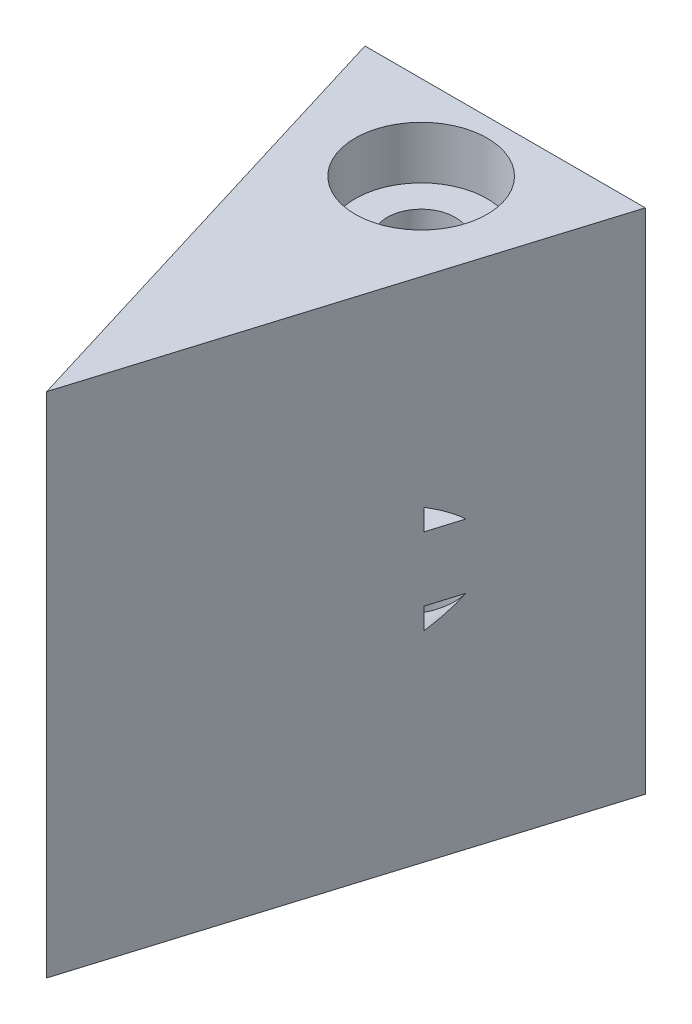
ISO-10303-21;
HEADER;
FILE_DESCRIPTION(('STEP AP214'),'2;1');
FILE_NAME('part.step','',(''),(''),'','','');
FILE_SCHEMA(('AUTOMOTIVE_DESIGN { 1 0 10303 214 1 1 1 1 }'));
ENDSEC;
DATA;
#1=APPLICATION_CONTEXT('core data for automotive mechanical design processes');
#2=APPLICATION_PROTOCOL_DEFINITION('international standard','automotive_design',2000,#1);
#3=PRODUCT_CONTEXT('',#1,'mechanical');
#4=PRODUCT('Part','Part','',(#3));
#5=PRODUCT_RELATED_PRODUCT_CATEGORY('part','',(#4));
#6=PRODUCT_DEFINITION_FORMATION('','',#4);
#7=PRODUCT_DEFINITION_CONTEXT('part definition',#1,'design');
#8=PRODUCT_DEFINITION('design','',#6,#7);
#9=PRODUCT_DEFINITION_SHAPE('','',#8);
#10=(LENGTH_UNIT() NAMED_UNIT(*) SI_UNIT(.MILLI.,.METRE.));
#11=(NAMED_UNIT(*) PLANE_ANGLE_UNIT() SI_UNIT($,.RADIAN.));
#12=(NAMED_UNIT(*) SI_UNIT($,.STERADIAN.) SOLID_ANGLE_UNIT());
#13=UNCERTAINTY_MEASURE_WITH_UNIT(LENGTH_MEASURE(1.E-05),#10,'distance_accuracy_value','');
#14=(GEOMETRIC_REPRESENTATION_CONTEXT(3) GLOBAL_UNCERTAINTY_ASSIGNED_CONTEXT((#13)) GLOBAL_UNIT_ASSIGNED_CONTEXT((#10,
#11,#12)) REPRESENTATION_CONTEXT('',''));
#15=CARTESIAN_POINT('',(0.,0.,0.));
#16=DIRECTION('',(0.,0.,1.));
#17=DIRECTION('',(1.,0.,0.));
#18=AXIS2_PLACEMENT_3D('',#15,#16,#17);
#19=CARTESIAN_POINT('',(-4.15957630186494,-2.51,4.56537000902889));
#20=DIRECTION('',(0.956304755963033,0.,-0.292371704722745));
#21=DIRECTION('',(-0.292371704722745,0.,-0.956304755963033));
#22=AXIS2_PLACEMENT_3D('',#19,#20,#21);
#23=PLANE('',#22);
#24=DIRECTION('',(0.,-1.,0.));
#25=VECTOR('',#24,1.);
#26=CARTESIAN_POINT('',(-2.63092289457158,5.,9.56537000902889));
#27=LINE('',#26,#25);
#28=CARTESIAN_POINT('',(-2.63092289457158,6.57662125269602,9.56537000902889));
#29=VERTEX_POINT('',#28);
#30=CARTESIAN_POINT('',(-2.63092289457158,5.95,9.56537000902889));
#31=VERTEX_POINT('',#30);
#32=EDGE_CURVE('E41',#29,#31,#27,.T.);
#33=ORIENTED_EDGE('',*,*,#32,.T.);
#34=DIRECTION('',(0.292371704722745,0.,0.956304755963033));
#35=VECTOR('',#34,1.);
#36=CARTESIAN_POINT('',(-2.15999244561512,5.95,11.105714101122));
#37=LINE('',#36,#35);
#38=CARTESIAN_POINT('',(-2.91830463710175,5.95,8.62538668396958));
#39=VERTEX_POINT('',#38);
#40=EDGE_CURVE('E168',#39,#31,#37,.T.);
#41=ORIENTED_EDGE('',*,*,#40,.F.);
#42=CARTESIAN_POINT('',(-0.0200292878638651,5.,18.1052181991121));
#43=DIRECTION('',(0.956304755963033,0.,-0.292371704722745));
#44=DIRECTION('',(-0.292371704722745,0.,-0.956304755963033));
#45=AXIS2_PLACEMENT_3D('',#42,#43,#44);
#46=ELLIPSE('',#45,10.4319260404912,3.05);
#47=EDGE_CURVE('E49',#29,#39,#46,.F.);
#48=ORIENTED_EDGE('',*,*,#47,.F.);
#49=EDGE_LOOP('',(#33,#41,#48));
#50=FACE_BOUND('',#49,.T.);
#51=DIRECTION('',(-0.292371704722745,0.,-0.956304755963033));
#52=VECTOR('',#51,1.);
#53=CARTESIAN_POINT('',(-2.15999244561512,4.05,11.105714101122));
#54=LINE('',#53,#52);
#55=CARTESIAN_POINT('',(-2.63092289457158,4.05,9.56537000902889));
#56=VERTEX_POINT('',#55);
#57=CARTESIAN_POINT('',(-2.91830463710175,4.05,8.62538668396958));
#58=VERTEX_POINT('',#57);
#59=EDGE_CURVE('E200',#56,#58,#54,.T.);
#60=ORIENTED_EDGE('',*,*,#59,.F.);
#61=DIRECTION('',(0.,-1.,0.));
#62=VECTOR('',#61,1.);
#63=CARTESIAN_POINT('',(-2.63092289457158,5.,9.56537000902889));
#64=LINE('',#63,#62);
#65=CARTESIAN_POINT('',(-2.63092289457158,3.42337874730398,9.56537000902889));
#66=VERTEX_POINT('',#65);
#67=EDGE_CURVE('E181',#56,#66,#64,.T.);
#68=ORIENTED_EDGE('',*,*,#67,.T.);
#69=CARTESIAN_POINT('',(-0.0200292878638651,5.,18.1052181991121));
#70=DIRECTION('',(0.956304755963033,0.,-0.292371704722745));
#71=DIRECTION('',(-0.292371704722745,0.,-0.956304755963033));
#72=AXIS2_PLACEMENT_3D('',#69,#70,#71);
#73=ELLIPSE('',#72,10.4319260404912,3.05);
#74=EDGE_CURVE('E204',#58,#66,#73,.F.);
#75=ORIENTED_EDGE('',*,*,#74,.F.);
#76=EDGE_LOOP('',(#60,#68,#75));
#77=FACE_BOUND('',#76,.T.);
#78=DIRECTION('',(0.,1.,0.));
#79=VECTOR('',#78,1.);
#80=CARTESIAN_POINT('',(-0.0200292878637983,-2.51,18.1052181991123));
#81=LINE('',#80,#79);
#82=CARTESIAN_POINT('',(-0.0200292878638,-2.5,18.1052181991123));
#83=VERTEX_POINT('',#82);
#84=CARTESIAN_POINT('',(-0.0200292878638,12.5,18.1052181991123));
#85=VERTEX_POINT('',#84);
#86=EDGE_CURVE('E11',#83,#85,#81,.T.);
#87=ORIENTED_EDGE('',*,*,#86,.T.);
#88=DIRECTION('',(-0.292371704722745,0.,-0.956304755963033));
#89=VECTOR('',#88,1.);
#90=CARTESIAN_POINT('',(-5.08047192639384,12.5,1.55325614418803));
#91=LINE('',#90,#89);
#92=CARTESIAN_POINT('',(-4.15957630186493,12.5,4.56537000902889));
#93=VERTEX_POINT('',#92);
#94=EDGE_CURVE('E182',#85,#93,#91,.T.);
#95=ORIENTED_EDGE('',*,*,#94,.T.);
#96=DIRECTION('',(0.,-1.,0.));
#97=VECTOR('',#96,1.);
#98=CARTESIAN_POINT('',(-4.15957630186494,-2.5,4.56537000902889));
#99=LINE('',#98,#97);
#100=CARTESIAN_POINT('',(-4.15957630186493,-2.5,4.56537000902889));
#101=VERTEX_POINT('',#100);
#102=EDGE_CURVE('E189',#93,#101,#99,.T.);
#103=ORIENTED_EDGE('',*,*,#102,.T.);
#104=DIRECTION('',(-0.292371704722745,0.,-0.956304755963033));
#105=VECTOR('',#104,1.);
#106=CARTESIAN_POINT('',(-5.08047192639384,-2.5,1.55325614418803));
#107=LINE('',#106,#105);
#108=EDGE_CURVE('E207',#83,#101,#107,.T.);
#109=ORIENTED_EDGE('',*,*,#108,.F.);
#110=EDGE_LOOP('',(#87,#95,#103,#109));
#111=FACE_BOUND('',#110,.T.);
#112=ADVANCED_FACE('F32',(#50,#77,#111),#23,.F.);
#113=CARTESIAN_POINT('',(-0.0200292878637983,-2.51,18.1052181991123));
#114=DIRECTION('',(-0.956304755963035,0.,-0.292371704722737));
#115=DIRECTION('',(-0.292371704722737,0.,0.956304755963036));
#116=AXIS2_PLACEMENT_3D('',#113,#114,#115);
#117=PLANE('',#116);
#118=DIRECTION('',(0.292371704722737,0.,-0.956304755963036));
#119=VECTOR('',#118,1.);
#120=CARTESIAN_POINT('',(2.61543005899706,5.95,9.48501909352394));
#121=LINE('',#120,#119);
#122=CARTESIAN_POINT('',(2.5908643188439,5.95,9.56537000902889));
#123=VERTEX_POINT('',#122);
#124=CARTESIAN_POINT('',(2.87824606137402,5.95,8.62538668396971));
#125=VERTEX_POINT('',#124);
#126=EDGE_CURVE('E196',#123,#125,#121,.T.);
#127=ORIENTED_EDGE('',*,*,#126,.F.);
#128=DIRECTION('',(0.,1.,0.));
#129=VECTOR('',#128,1.);
#130=CARTESIAN_POINT('',(2.5908643188439,5.,9.56537000902889));
#131=LINE('',#130,#129);
#132=CARTESIAN_POINT('',(2.5908643188439,6.57662125269594,9.56537000902889));
#133=VERTEX_POINT('',#132);
#134=EDGE_CURVE('E179',#123,#133,#131,.T.);
#135=ORIENTED_EDGE('',*,*,#134,.T.);
#136=CARTESIAN_POINT('',(-0.0200292878638651,5.,18.1052181991125));
#137=DIRECTION('',(-0.956304755963035,0.,-0.292371704722737));
#138=DIRECTION('',(0.292371704722737,0.,-0.956304755963036));
#139=AXIS2_PLACEMENT_3D('',#136,#137,#138);
#140=ELLIPSE('',#139,10.4319260404915,3.05);
#141=EDGE_CURVE('E57',#125,#133,#140,.F.);
#142=ORIENTED_EDGE('',*,*,#141,.F.);
#143=EDGE_LOOP('',(#127,#135,#142));
#144=FACE_BOUND('',#143,.T.);
#145=DIRECTION('',(0.,1.,0.));
#146=VECTOR('',#145,1.);
#147=CARTESIAN_POINT('',(2.5908643188439,5.,9.56537000902889));
#148=LINE('',#147,#146);
#149=CARTESIAN_POINT('',(2.5908643188439,3.42337874730406,9.56537000902889));
#150=VERTEX_POINT('',#149);
#151=CARTESIAN_POINT('',(2.5908643188439,4.05,9.56537000902889));
#152=VERTEX_POINT('',#151);
#153=EDGE_CURVE('E185',#150,#152,#148,.T.);
#154=ORIENTED_EDGE('',*,*,#153,.T.);
#155=DIRECTION('',(-0.292371704722737,0.,0.956304755963036));
#156=VECTOR('',#155,1.);
#157=CARTESIAN_POINT('',(2.61543005899706,4.05,9.48501909352394));
#158=LINE('',#157,#156);
#159=CARTESIAN_POINT('',(2.87824606137402,4.05,8.62538668396971));
#160=VERTEX_POINT('',#159);
#161=EDGE_CURVE('E203',#160,#152,#158,.T.);
#162=ORIENTED_EDGE('',*,*,#161,.F.);
#163=CARTESIAN_POINT('',(-0.0200292878638651,5.,18.1052181991125));
#164=DIRECTION('',(-0.956304755963035,0.,-0.292371704722737));
#165=DIRECTION('',(0.292371704722737,0.,-0.956304755963036));
#166=AXIS2_PLACEMENT_3D('',#163,#164,#165);
#167=ELLIPSE('',#166,10.4319260404915,3.05);
#168=EDGE_CURVE('E206',#150,#160,#167,.F.);
#169=ORIENTED_EDGE('',*,*,#168,.F.);
#170=EDGE_LOOP('',(#154,#162,#169));
#171=FACE_BOUND('',#170,.T.);
#172=DIRECTION('',(0.,1.,0.));
#173=VECTOR('',#172,1.);
#174=CARTESIAN_POINT('',(4.1195177261372,-2.5,4.56537000902889));
#175=LINE('',#174,#173);
#176=CARTESIAN_POINT('',(4.1195177261372,-2.5,4.56537000902889));
#177=VERTEX_POINT('',#176);
#178=CARTESIAN_POINT('',(4.1195177261372,12.5,4.56537000902889));
#179=VERTEX_POINT('',#178);
#180=EDGE_CURVE('E192',#177,#179,#175,.T.);
#181=ORIENTED_EDGE('',*,*,#180,.T.);
#182=DIRECTION('',(-0.292371704722737,0.,0.956304755963036));
#183=VECTOR('',#182,1.);
#184=CARTESIAN_POINT('',(5.04383760633929,12.5,1.54205590855293));
#185=LINE('',#184,#183);
#186=EDGE_CURVE('E186',#179,#85,#185,.T.);
#187=ORIENTED_EDGE('',*,*,#186,.T.);
#188=ORIENTED_EDGE('',*,*,#86,.F.);
#189=DIRECTION('',(-0.292371704722737,0.,0.956304755963036));
#190=VECTOR('',#189,1.);
#191=CARTESIAN_POINT('',(5.04383760633929,-2.5,1.54205590855293));
#192=LINE('',#191,#190);
#193=EDGE_CURVE('E36',#177,#83,#192,.T.);
#194=ORIENTED_EDGE('',*,*,#193,.F.);
#195=EDGE_LOOP('',(#181,#187,#188,#194));
#196=FACE_BOUND('',#195,.T.);
#197=ADVANCED_FACE('F34',(#144,#171,#196),#117,.F.);
#198=CARTESIAN_POINT('',(0.,10.95,7.06537000902889));
#199=DIRECTION('',(0.,1.,0.));
#200=DIRECTION('',(0.,0.,1.));
#201=AXIS2_PLACEMENT_3D('',#198,#199,#200);
#202=PLANE('',#201);
#203=CARTESIAN_POINT('',(0.,10.95,7.06537000902889));
#204=DIRECTION('',(0.,1.,0.));
#205=DIRECTION('',(0.,0.,1.));
#206=AXIS2_PLACEMENT_3D('',#203,#204,#205);
#207=CIRCLE('',#206,1.95);
#208=CARTESIAN_POINT('',(0.,10.95,9.01537000902889));
#209=VERTEX_POINT('',#208);
#210=EDGE_CURVE('E177',#209,#209,#207,.T.);
#211=ORIENTED_EDGE('',*,*,#210,.T.);
#212=EDGE_LOOP('',(#211));
#213=FACE_BOUND('',#212,.T.);
#214=CARTESIAN_POINT('',(0.,10.95,7.06537000902889));
#215=DIRECTION('',(0.,1.,0.));
#216=DIRECTION('',(0.,0.,1.));
#217=AXIS2_PLACEMENT_3D('',#214,#215,#216);
#218=CIRCLE('',#217,0.999999999999795);
#219=CARTESIAN_POINT('',(0.,10.95,8.06537000902868));
#220=VERTEX_POINT('',#219);
#221=EDGE_CURVE('E174',#220,#220,#218,.F.);
#222=ORIENTED_EDGE('',*,*,#221,.T.);
#223=EDGE_LOOP('',(#222));
#224=FACE_BOUND('',#223,.T.);
#225=ADVANCED_FACE('F250',(#213,#224),#202,.T.);
#226=CARTESIAN_POINT('',(0.,10.95,7.06537000902889));
#227=DIRECTION('',(0.,1.,0.));
#228=DIRECTION('',(0.,0.,1.));
#229=AXIS2_PLACEMENT_3D('',#226,#227,#228);
#230=CYLINDRICAL_SURFACE('',#229,1.95);
#231=CARTESIAN_POINT('',(0.,12.5,7.06537000902889));
#232=DIRECTION('',(0.,1.,0.));
#233=DIRECTION('',(0.,0.,1.));
#234=AXIS2_PLACEMENT_3D('',#231,#232,#233);
#235=CIRCLE('',#234,1.95);
#236=CARTESIAN_POINT('',(0.,12.5,9.01537000902889));
#237=VERTEX_POINT('',#236);
#238=EDGE_CURVE('E398',#237,#237,#235,.T.);
#239=CARTESIAN_POINT('',(0.,10.95,9.01537000902889));
#240=CARTESIAN_POINT('',(0.,10.9661458333333,9.01537000902889));
#241=CARTESIAN_POINT('',(0.,10.9822916666667,9.01537000902889));
#242=CARTESIAN_POINT('',(0.,11.0145833333333,9.01537000902889));
#243=CARTESIAN_POINT('',(0.,11.0307291666667,9.01537000902889));
#244=CARTESIAN_POINT('',(0.,11.0630208333333,9.01537000902889));
#245=CARTESIAN_POINT('',(0.,11.0791666666667,9.01537000902889));
#246=CARTESIAN_POINT('',(0.,11.1114583333333,9.01537000902889));
#247=CARTESIAN_POINT('',(0.,11.1276041666667,9.01537000902889));
#248=CARTESIAN_POINT('',(0.,11.1598958333333,9.01537000902889));
#249=CARTESIAN_POINT('',(0.,11.1760416666667,9.01537000902889));
#250=CARTESIAN_POINT('',(0.,11.2083333333333,9.01537000902889));
#251=CARTESIAN_POINT('',(0.,11.2244791666667,9.01537000902889));
#252=CARTESIAN_POINT('',(0.,11.2567708333333,9.01537000902889));
#253=CARTESIAN_POINT('',(0.,11.2729166666667,9.01537000902889));
#254=CARTESIAN_POINT('',(0.,11.3052083333333,9.01537000902889));
#255=CARTESIAN_POINT('',(0.,11.3213541666667,9.01537000902889));
#256=CARTESIAN_POINT('',(0.,11.3536458333333,9.01537000902889));
#257=CARTESIAN_POINT('',(0.,11.3697916666667,9.01537000902889));
#258=CARTESIAN_POINT('',(0.,11.4020833333333,9.01537000902889));
#259=CARTESIAN_POINT('',(0.,11.4182291666667,9.01537000902889));
#260=CARTESIAN_POINT('',(0.,11.4505208333333,9.01537000902889));
#261=CARTESIAN_POINT('',(0.,11.4666666666667,9.01537000902889));
#262=CARTESIAN_POINT('',(0.,11.4989583333333,9.01537000902889));
#263=CARTESIAN_POINT('',(0.,11.5151041666667,9.01537000902889));
#264=CARTESIAN_POINT('',(0.,11.5473958333333,9.01537000902889));
#265=CARTESIAN_POINT('',(0.,11.5635416666667,9.01537000902889));
#266=CARTESIAN_POINT('',(0.,11.5958333333333,9.01537000902889));
#267=CARTESIAN_POINT('',(0.,11.6119791666667,9.01537000902889));
#268=CARTESIAN_POINT('',(0.,11.6442708333333,9.01537000902889));
#269=CARTESIAN_POINT('',(0.,11.6604166666667,9.01537000902889));
#270=CARTESIAN_POINT('',(0.,11.6927083333333,9.01537000902889));
#271=CARTESIAN_POINT('',(0.,11.7088541666667,9.01537000902889));
#272=CARTESIAN_POINT('',(0.,11.7411458333333,9.01537000902889));
#273=CARTESIAN_POINT('',(0.,11.7572916666667,9.01537000902889));
#274=CARTESIAN_POINT('',(0.,11.7895833333333,9.01537000902889));
#275=CARTESIAN_POINT('',(0.,11.8057291666667,9.01537000902889));
#276=CARTESIAN_POINT('',(0.,11.8380208333333,9.01537000902889));
#277=CARTESIAN_POINT('',(0.,11.8541666666667,9.01537000902889));
#278=CARTESIAN_POINT('',(0.,11.8864583333333,9.01537000902889));
#279=CARTESIAN_POINT('',(0.,11.9026041666667,9.01537000902889));
#280=CARTESIAN_POINT('',(0.,11.9348958333333,9.01537000902889));
#281=CARTESIAN_POINT('',(0.,11.9510416666667,9.01537000902889));
#282=CARTESIAN_POINT('',(0.,11.9833333333333,9.01537000902889));
#283=CARTESIAN_POINT('',(0.,11.9994791666667,9.01537000902889));
#284=CARTESIAN_POINT('',(0.,12.0317708333333,9.01537000902889));
#285=CARTESIAN_POINT('',(0.,12.0479166666667,9.01537000902889));
#286=CARTESIAN_POINT('',(0.,12.0802083333333,9.01537000902889));
#287=CARTESIAN_POINT('',(0.,12.0963541666667,9.01537000902889));
#288=CARTESIAN_POINT('',(0.,12.1286458333333,9.01537000902889));
#289=CARTESIAN_POINT('',(0.,12.1447916666667,9.01537000902889));
#290=CARTESIAN_POINT('',(0.,12.1770833333333,9.01537000902889));
#291=CARTESIAN_POINT('',(0.,12.1932291666667,9.01537000902889));
#292=CARTESIAN_POINT('',(0.,12.2255208333333,9.01537000902889));
#293=CARTESIAN_POINT('',(0.,12.2416666666667,9.01537000902889));
#294=CARTESIAN_POINT('',(0.,12.2739583333333,9.01537000902889));
#295=CARTESIAN_POINT('',(0.,12.2901041666667,9.01537000902889));
#296=CARTESIAN_POINT('',(0.,12.3223958333333,9.01537000902889));
#297=CARTESIAN_POINT('',(0.,12.3385416666667,9.01537000902889));
#298=CARTESIAN_POINT('',(0.,12.3708333333333,9.01537000902889));
#299=CARTESIAN_POINT('',(0.,12.3869791666667,9.01537000902889));
#300=CARTESIAN_POINT('',(0.,12.4192708333333,9.01537000902889));
#301=CARTESIAN_POINT('',(0.,12.4354166666667,9.01537000902889));
#302=CARTESIAN_POINT('',(0.,12.4677083333333,9.01537000902889));
#303=CARTESIAN_POINT('',(0.,12.4838541666667,9.01537000902889));
#304=CARTESIAN_POINT('',(0.,12.5,9.01537000902889));
#305=B_SPLINE_CURVE_WITH_KNOTS('',3,(#239,#240,#241,#242,#243,#244,#245,#246,#247,#248,#249,
#250,#251,#252,#253,#254,#255,#256,#257,#258,#259,#260,#261,#262,#263,#264,#265,#266,#267,#268,
#269,#270,#271,#272,#273,#274,#275,#276,#277,#278,#279,#280,#281,#282,#283,#284,#285,#286,#287,
#288,#289,#290,#291,#292,#293,#294,#295,#296,#297,#298,#299,#300,#301,#302,#303,#304),
.UNSPECIFIED.,.F.,.F.,(4,2,2,2,2,2,2,2,2,2,2,2,2,2,2,2,2,2,2,2,2,2,2,2,2,2,2,2,2,2,2,2,4),(0.,
0.0484375000000016,0.0968750000000015,0.145312500000001,0.193750000000001,0.242187500000001,
0.290625000000001,0.339062500000001,0.387500000000001,0.435937500000001,0.484375,0.5328125,
0.58125,0.6296875,0.678125,0.7265625,0.775,0.823437500000001,0.871875000000001,
0.920312500000001,0.968750000000001,1.0171875,1.065625,1.1140625,1.1625,1.2109375,1.259375,
1.3078125,1.35625,1.4046875,1.453125,1.5015625,1.55),.UNSPECIFIED.);
#306=EDGE_CURVE('BSEAM271',#209,#237,#305,.T.);
#307=ORIENTED_EDGE('',*,*,#210,.F.);
#308=ORIENTED_EDGE('',*,*,#238,.T.);
#309=ORIENTED_EDGE('',*,*,#306,.T.);
#310=ORIENTED_EDGE('',*,*,#306,.F.);
#311=EDGE_LOOP('',(#307,#309,#308,#310));
#312=FACE_BOUND('',#311,.T.);
#313=ADVANCED_FACE('F271',(#312),#230,.F.);
#314=CARTESIAN_POINT('',(0.,-2.5,7.06537000902889));
#315=DIRECTION('',(0.,1.,0.));
#316=DIRECTION('',(0.,0.,1.));
#317=AXIS2_PLACEMENT_3D('',#314,#315,#316);
#318=CYLINDRICAL_SURFACE('',#317,0.999999999999795);
#319=CARTESIAN_POINT('',(0.,-2.5,7.06537000902889));
#320=DIRECTION('',(0.,1.,0.));
#321=DIRECTION('',(0.,0.,1.));
#322=AXIS2_PLACEMENT_3D('',#319,#320,#321);
#323=CIRCLE('',#322,0.999999999999795);
#324=CARTESIAN_POINT('',(0.,-2.5,8.06537000902868));
#325=VERTEX_POINT('',#324);
#326=EDGE_CURVE('E173',#325,#325,#323,.T.);
#327=ORIENTED_EDGE('',*,*,#326,.F.);
#328=EDGE_LOOP('',(#327));
#329=FACE_BOUND('',#328,.T.);
#330=CARTESIAN_POINT('',(0.,1.95006576667174,8.06537000902868));
#331=CARTESIAN_POINT('',(-0.0545467083170213,1.94970747285087,8.06537014842768));
#332=CARTESIAN_POINT('',(-0.109102594425875,1.95082617973328,8.0608924995377));
#333=CARTESIAN_POINT('',(-0.216630559947825,1.95586683343102,8.04314372343465));
#334=CARTESIAN_POINT('',(-0.269602455019722,1.95978910520613,8.02987157686885));
#335=CARTESIAN_POINT('',(-0.372395540865111,1.96998281568037,7.9950275098491));
#336=CARTESIAN_POINT('',(-0.422221565195225,1.97625054265354,7.973468701733));
#337=CARTESIAN_POINT('',(-0.517558158763021,1.99046661490332,7.92272142069787));
#338=CARTESIAN_POINT('',(-0.563067913976883,1.9984152762853,7.89353151248061));
#339=CARTESIAN_POINT('',(-0.649966255197754,2.0154231807719,7.82735020137387));
#340=CARTESIAN_POINT('',(-0.691194169171496,2.02450822082243,7.79015451043477));
#341=CARTESIAN_POINT('',(-0.766956256715783,2.04261595831002,7.7094526800914));
#342=CARTESIAN_POINT('',(-0.801489039696813,2.05163864242117,7.66594523299885));
#343=CARTESIAN_POINT('',(-0.863833114798163,2.06886144062743,7.57236170710818));
#344=CARTESIAN_POINT('',(-0.891427757355958,2.07703123807653,7.5221351619421));
#345=CARTESIAN_POINT('',(-0.937715224095409,2.09122999962885,7.41745339240553));
#346=CARTESIAN_POINT('',(-0.956410489644233,2.09725955075052,7.36299933254285));
#347=CARTESIAN_POINT('',(-0.98378774157987,2.10623552314352,7.25316209699885));
#348=CARTESIAN_POINT('',(-0.992758921547917,2.10927073194073,7.19785848159756));
#349=CARTESIAN_POINT('',(-1.00133622536939,2.1121705310223,7.08645414512163));
#350=CARTESIAN_POINT('',(-1.00094504098822,2.11203603262665,7.03035365779079));
#351=CARTESIAN_POINT('',(-0.991038308718468,2.10869152283109,6.92147912268892));
#352=CARTESIAN_POINT('',(-0.981911130689609,2.10561242249054,6.86866501351363));
#353=CARTESIAN_POINT('',(-0.955426185023448,2.09694560803578,6.76536168143749));
#354=CARTESIAN_POINT('',(-0.938067486579282,2.09135761022334,6.71487272216934));
#355=CARTESIAN_POINT('',(-0.895355477528405,2.07821837470153,6.6167672431692));
#356=CARTESIAN_POINT('',(-0.869886126954097,2.07063893932841,6.5692051855977));
#357=CARTESIAN_POINT('',(-0.811753224255465,2.05439616233121,6.47890419675966));
#358=CARTESIAN_POINT('',(-0.779087700884409,2.04573252399295,6.43616659191586));
#359=CARTESIAN_POINT('',(-0.705621370189618,2.02780243830253,6.35455640683283));
#360=CARTESIAN_POINT('',(-0.664503649472307,2.01852709526581,6.31597050530051));
#361=CARTESIAN_POINT('',(-0.57625917050636,2.00081162712214,6.24616898216816));
#362=CARTESIAN_POINT('',(-0.529131951252226,1.99237156618035,6.21495392653086));
#363=CARTESIAN_POINT('',(-0.42967631027486,1.97721392807559,6.16059752963539));
#364=CARTESIAN_POINT('',(-0.377310405391615,1.97051020892516,6.13752064297751));
#365=CARTESIAN_POINT('',(-0.269171299120882,1.9597079998363,6.10058591678685));
#366=CARTESIAN_POINT('',(-0.213399241292621,1.95560864074058,6.08672500152104));
#367=CARTESIAN_POINT('',(-0.10253908456766,1.95063259271298,6.06912548318687));
#368=CARTESIAN_POINT('',(-0.0475199824239522,1.94962825812152,6.06498767267624));
#369=CARTESIAN_POINT('',(0.0624178408306011,1.95061930503421,6.06580783262257));
#370=CARTESIAN_POINT('',(0.117336575934049,1.95261423039507,6.07076441998072));
#371=CARTESIAN_POINT('',(0.224019697915292,1.95932166494474,6.08932142334608));
#372=CARTESIAN_POINT('',(0.275829029613629,1.96396161104079,6.10269199072763));
#373=CARTESIAN_POINT('',(0.376441018754687,1.97545416982598,6.1374016340776));
#374=CARTESIAN_POINT('',(0.425243272951458,1.98230707850544,6.15874177606015));
#375=CARTESIAN_POINT('',(0.519942958677845,1.99778474493448,6.20943615236094));
#376=CARTESIAN_POINT('',(0.565724086676077,2.00645292462781,6.23899404054972));
#377=CARTESIAN_POINT('',(0.65180500165392,2.02458793082162,6.30504407730197));
#378=CARTESIAN_POINT('',(0.692103118494657,2.03405499924922,6.34153833062207));
#379=CARTESIAN_POINT('',(0.767932225486806,2.05327037108428,6.42234306540777));
#380=CARTESIAN_POINT('',(0.803172677487142,2.06301253612594,6.46692833440378));
#381=CARTESIAN_POINT('',(0.865699423276716,2.08125899142385,6.5616021249502));
#382=CARTESIAN_POINT('',(0.892985766856479,2.08976328942864,6.61169061204926));
#383=CARTESIAN_POINT('',(0.938651779165637,2.10448494111707,6.71586576519746));
#384=CARTESIAN_POINT('',(0.957065998669795,2.11071114322027,6.76993596046547));
#385=CARTESIAN_POINT('',(0.984445615434366,2.12011390689645,6.88066589489971));
#386=CARTESIAN_POINT('',(0.993415282022461,2.12329184635206,6.93732445192374));
#387=CARTESIAN_POINT('',(1.00132679388868,2.12609197133263,7.04845788777591));
#388=CARTESIAN_POINT('',(1.00076507768828,2.12589019545742,7.10289342027352));
#389=CARTESIAN_POINT('',(0.990844746741187,2.12238627741313,7.21085016959212));
#390=CARTESIAN_POINT('',(0.981486635847406,2.11908431282127,7.26437143860285));
#391=CARTESIAN_POINT('',(0.954582416471499,2.1098742046831,7.36800345557402));
#392=CARTESIAN_POINT('',(0.937190144831295,2.10401513574912,7.41815883854906));
#393=CARTESIAN_POINT('',(0.894835988822796,2.090358382842,7.51487803621554));
#394=CARTESIAN_POINT('',(0.869872431323104,2.08256027044038,7.56144105419678));
#395=CARTESIAN_POINT('',(0.811804845722808,2.06546338643234,7.65187315687851));
#396=CARTESIAN_POINT('',(0.778391036585527,2.05611369258926,7.69553364274029));
#397=CARTESIAN_POINT('',(0.704904242322278,2.03716191630836,7.77678571189248));
#398=CARTESIAN_POINT('',(0.664829330890099,2.02755976154021,7.81437553340602));
#399=CARTESIAN_POINT('',(0.577262492650444,2.0087087644859,7.88391432033876));
#400=CARTESIAN_POINT('',(0.529540250451134,1.99948882586492,7.91558208528871));
#401=CARTESIAN_POINT('',(0.42915302715261,1.98282933317401,7.97040925400301));
#402=CARTESIAN_POINT('',(0.376489408870778,1.97538929021161,7.99357099509525));
#403=CARTESIAN_POINT('',(0.270526055479718,1.96342787080536,8.02962243255354));
#404=CARTESIAN_POINT('',(0.21740168051063,1.95877488381879,8.04298349104672));
#405=CARTESIAN_POINT('',(0.109520989825704,1.95227407622703,8.06085600970638));
#406=CARTESIAN_POINT('',(0.0547651206314484,1.95042549514897,8.06536986907151));
#407=CARTESIAN_POINT('',(0.,1.95006576667174,8.06537000902868));
#408=B_SPLINE_CURVE_WITH_KNOTS('',3,(#330,#331,#332,#333,#334,#335,#336,#337,#338,#339,#340,
#341,#342,#343,#344,#345,#346,#347,#348,#349,#350,#351,#352,#353,#354,#355,#356,#357,#358,#359,
#360,#361,#362,#363,#364,#365,#366,#367,#368,#369,#370,#371,#372,#373,#374,#375,#376,#377,#378,
#379,#380,#381,#382,#383,#384,#385,#386,#387,#388,#389,#390,#391,#392,#393,#394,#395,#396,#397,
#398,#399,#400,#401,#402,#403,#404,#405,#406,#407),.UNSPECIFIED.,.T.,.F.,(4,2,2,2,2,2,2,2,2,2,2,
2,2,2,2,2,2,2,2,2,2,2,2,2,2,2,2,2,2,2,2,2,2,2,2,2,2,2,4),(0.,0.163442738145022,
0.326904423927134,0.490108515076376,0.653343324638449,0.821381387841708,0.989454315519196,
1.16225995148931,1.33501815430968,1.50248425360626,1.66990220544567,1.83020712775361,
1.99053018140408,2.15325864915569,2.31603174864767,2.48667281288232,2.65732697535582,
2.82930387628821,3.00122335289978,3.16595058911983,3.33065277528572,3.49104017270917,
3.65144903131624,3.81625518004188,3.98111141728132,4.15327611944035,4.32543974387269,
4.49692737970757,4.66833746273024,4.83084843459238,4.993350098478,5.15286155264116,
5.31240828196405,5.4789731824826,5.64558633552872,5.81877562096729,5.9919172809142,
6.15605898403024,6.32015616875538),.UNSPECIFIED.);
#409=CARTESIAN_POINT('',(0.,1.95006576667174,8.06537000902868));
#410=VERTEX_POINT('',#409);
#411=EDGE_CURVE('E137',#410,#410,#408,.T.);
#412=ORIENTED_EDGE('',*,*,#411,.F.);
#413=EDGE_LOOP('',(#412));
#414=FACE_BOUND('',#413,.T.);
#415=ADVANCED_FACE('F266',(#329,#414),#318,.F.);
#416=CARTESIAN_POINT('',(0.,8.04993423332826,8.06537000902868));
#417=CARTESIAN_POINT('',(0.0546821791008591,8.04957510796066,8.06537003134291));
#418=CARTESIAN_POINT('',(0.109354914126314,8.04773172784493,8.0608700796451));
#419=CARTESIAN_POINT('',(0.217072928600975,8.04124911512673,8.0430513451388));
#420=CARTESIAN_POINT('',(0.270117951898954,8.03660944482241,8.02973118167488));
#421=CARTESIAN_POINT('',(0.373013096085542,8.02501178523379,7.9947834956713));
#422=CARTESIAN_POINT('',(0.422868473539478,8.01805773388006,7.97317007466059));
#423=CARTESIAN_POINT('',(0.518239677542278,8.00251631313627,7.92231226129294));
#424=CARTESIAN_POINT('',(0.563754694999946,7.99392864011109,7.89306644995588));
#425=CARTESIAN_POINT('',(0.650728756928365,7.97567153728033,7.82670873711478));
#426=CARTESIAN_POINT('',(0.692016888170353,7.96597671144104,7.789379829442));
#427=CARTESIAN_POINT('',(0.767869116779319,7.94673554743408,7.7083762283634));
#428=CARTESIAN_POINT('',(0.802431776578928,7.93718924141278,7.66470018173609));
#429=CARTESIAN_POINT('',(0.864765151781457,7.91902793004534,7.5707826132558));
#430=CARTESIAN_POINT('',(0.892326299349008,7.91044519441132,7.52039518357941));
#431=CARTESIAN_POINT('',(0.938505856826815,7.89556616206647,7.41536260915563));
#432=CARTESIAN_POINT('',(0.957127077871142,7.88926914676962,7.36071880910146));
#433=CARTESIAN_POINT('',(0.984242433141647,7.87995461814357,7.25073786122397));
#434=CARTESIAN_POINT('',(0.993067689027361,7.87683020189835,7.19549165552765));
#435=CARTESIAN_POINT('',(1.00137637507627,7.87389140563375,7.0842210997125));
#436=CARTESIAN_POINT('',(1.00086267310011,7.87407600946129,7.02819699375629));
#437=CARTESIAN_POINT('',(0.99076096088365,7.87764266918273,6.91967266210838));
#438=CARTESIAN_POINT('',(0.981587657973599,7.88087859001705,6.86712821582431));
#439=CARTESIAN_POINT('',(0.955100149434765,7.8899509641507,6.76437204334019));
#440=CARTESIAN_POINT('',(0.937784973426303,7.89578772742408,6.71416059597993));
#441=CARTESIAN_POINT('',(0.895224866547381,7.90952145894585,6.61653210436769));
#442=CARTESIAN_POINT('',(0.869854126003332,7.91745075100137,6.56917464604347));
#443=CARTESIAN_POINT('',(0.811993742784764,7.93447527343163,6.47925869308694));
#444=CARTESIAN_POINT('',(0.779502046774439,7.94357083978839,6.43670158801433));
#445=CARTESIAN_POINT('',(0.706310455681535,7.96250407370069,6.35524458013623));
#446=CARTESIAN_POINT('',(0.665269123333407,7.97235562915799,6.31665408360598));
#447=CARTESIAN_POINT('',(0.57718349640282,7.99129803558887,6.24682351617368));
#448=CARTESIAN_POINT('',(0.530138584475256,8.00038880817212,6.21558420213093));
#449=CARTESIAN_POINT('',(0.430676287465459,8.01694054662288,6.16106484602444));
#450=CARTESIAN_POINT('',(0.378205748438876,8.0243825903494,6.13787563631923));
#451=CARTESIAN_POINT('',(0.269803272333861,8.03668686866806,6.10075330920549));
#452=CARTESIAN_POINT('',(0.213872509814023,8.04154997336318,6.08681706955583));
#453=CARTESIAN_POINT('',(0.102675980012124,8.04801791966975,6.06913107849329));
#454=CARTESIAN_POINT('',(0.0474822649655247,8.04975195790472,6.06497514173016));
#455=CARTESIAN_POINT('',(-0.0628415625782379,8.05019803748363,6.0658238541015));
#456=CARTESIAN_POINT('',(-0.11797168444029,8.04891060250071,6.07082691579136));
#457=CARTESIAN_POINT('',(-0.224905098860222,8.04356865345438,6.0895227717292));
#458=CARTESIAN_POINT('',(-0.27675855569376,8.03959688095123,6.10295488916953));
#459=CARTESIAN_POINT('',(-0.377465816854332,8.02940636298488,6.13781410513821));
#460=CARTESIAN_POINT('',(-0.426319262034692,8.02318734910412,6.15924215873627));
#461=CARTESIAN_POINT('',(-0.520961047176242,8.00897230857037,6.2100604659352));
#462=CARTESIAN_POINT('',(-0.566646489467878,8.0009368899842,6.2396309979426));
#463=CARTESIAN_POINT('',(-0.65254261544519,7.98401517307969,6.30568228657445));
#464=CARTESIAN_POINT('',(-0.692751707956591,7.97512862873551,6.34216504424128));
#465=CARTESIAN_POINT('',(-0.768368832186386,7.9570367257478,6.42287653863802));
#466=CARTESIAN_POINT('',(-0.803492685593696,7.94783427305369,6.46737277538544));
#467=CARTESIAN_POINT('',(-0.865812896971176,7.93056297373217,6.561814306128));
#468=CARTESIAN_POINT('',(-0.893009191170616,7.92249413622404,6.61175964395225));
#469=CARTESIAN_POINT('',(-0.938600028099442,7.908487452095,6.71573217026841));
#470=CARTESIAN_POINT('',(-0.957006080265417,7.90254682148472,6.76975391336835));
#471=CARTESIAN_POINT('',(-0.984385447206509,7.89356679235751,6.88036261430816));
#472=CARTESIAN_POINT('',(-0.993362642639482,7.89052620031194,6.93694850680402));
#473=CARTESIAN_POINT('',(-1.00133163032267,7.88782991758724,7.04818230585044));
#474=CARTESIAN_POINT('',(-1.00077845522218,7.8880199719282,7.10279422493158));
#475=CARTESIAN_POINT('',(-0.990816979227545,7.89138344959095,7.21110590212351));
#476=CARTESIAN_POINT('',(-0.981409159874996,7.89455671067717,7.26480570967594));
#477=CARTESIAN_POINT('',(-0.954326006544325,7.90340934975765,7.36885594585062));
#478=CARTESIAN_POINT('',(-0.936795159679116,7.9090448351629,7.41924801009586));
#479=CARTESIAN_POINT('',(-0.894078597598813,7.92216267155434,7.51641516301269));
#480=CARTESIAN_POINT('',(-0.868891247980455,7.92964541680364,7.56318947674054));
#481=CARTESIAN_POINT('',(-0.810369867509382,7.94598359665686,7.6538685388687));
#482=CARTESIAN_POINT('',(-0.776744477808668,7.95488269367938,7.69757735474066));
#483=CARTESIAN_POINT('',(-0.702796321419838,7.97283954400193,7.77888143930107));
#484=CARTESIAN_POINT('',(-0.662471761379352,7.98189733920272,7.81647506561977));
#485=CARTESIAN_POINT('',(-0.574566833244119,7.99951060425292,7.88580532807814));
#486=CARTESIAN_POINT('',(-0.526781666832324,8.00803733466461,7.91729045245042));
#487=CARTESIAN_POINT('',(-0.42631739774142,8.02324420992155,7.97174481231142));
#488=CARTESIAN_POINT('',(-0.373639825535698,8.02992492966523,7.99471669981805));
#489=CARTESIAN_POINT('',(-0.268082191246842,8.04033135878708,8.03027889077588));
#490=CARTESIAN_POINT('',(-0.215395649662781,8.0442075496374,8.0433995880839));
#491=CARTESIAN_POINT('',(-0.108469393021745,8.04918673358594,8.06094409709436));
#492=CARTESIAN_POINT('',(-0.0542300522364904,8.05029038935139,8.06536998689896));
#493=CARTESIAN_POINT('',(0.,8.04993423332826,8.06537000902868));
#494=B_SPLINE_CURVE_WITH_KNOTS('',3,(#416,#417,#418,#419,#420,#421,#422,#423,#424,#425,#426,
#427,#428,#429,#430,#431,#432,#433,#434,#435,#436,#437,#438,#439,#440,#441,#442,#443,#444,#445,
#446,#447,#448,#449,#450,#451,#452,#453,#454,#455,#456,#457,#458,#459,#460,#461,#462,#463,#464,
#465,#466,#467,#468,#469,#470,#471,#472,#473,#474,#475,#476,#477,#478,#479,#480,#481,#482,#483,
#484,#485,#486,#487,#488,#489,#490,#491,#492,#493),.UNSPECIFIED.,.T.,.F.,(4,2,2,2,2,2,2,2,2,2,2,
2,2,2,2,2,2,2,2,2,2,2,2,2,2,2,2,2,2,2,2,2,2,2,2,2,2,2,4),(0.,0.163850025249576,
0.327725704522648,0.491323962064708,0.654952656763252,0.823688007705309,0.992459386251062,
1.16580686426493,1.33909979790541,1.50633759959778,1.67352404581624,1.83308952664912,
1.99267402993055,2.15488479838887,2.31714240219587,2.48792062945066,2.65871643191758,
2.83138111770078,3.00398751137513,3.16928819199399,3.33456022528501,3.49495717905625,
3.65537329747941,3.81967478229688,3.98402390415546,4.15550728499603,4.32699204524211,
4.49825165341348,4.66944074819149,4.83247997411711,4.99551033400225,5.15574601024891,
5.31601591541804,5.48284858292629,5.64972598333098,5.8224532304353,5.99512662474744,
6.15766074540814,6.32015601487876),.UNSPECIFIED.);
#495=CARTESIAN_POINT('',(0.,8.04993423332826,8.06537000902868));
#496=VERTEX_POINT('',#495);
#497=EDGE_CURVE('E172',#496,#496,#494,.T.);
#498=ORIENTED_EDGE('',*,*,#497,.F.);
#499=EDGE_LOOP('',(#498));
#500=FACE_BOUND('',#499,.T.);
#501=ORIENTED_EDGE('',*,*,#221,.F.);
#502=EDGE_LOOP('',(#501));
#503=FACE_BOUND('',#502,.T.);
#504=ADVANCED_FACE('F256',(#500,#503),#318,.F.);
#505=CARTESIAN_POINT('',(4.64236360438078,-2.5,4.56537000902889));
#506=DIRECTION('',(0.,0.,-1.));
#507=DIRECTION('',(-1.,0.,0.));
#508=AXIS2_PLACEMENT_3D('',#505,#506,#507);
#509=PLANE('',#508);
#510=ORIENTED_EDGE('',*,*,#180,.F.);
#511=DIRECTION('',(-1.,0.,0.));
#512=VECTOR('',#511,1.);
#513=CARTESIAN_POINT('',(4.64236360438078,-2.5,4.56537000902889));
#514=LINE('',#513,#512);
#515=EDGE_CURVE('E165',#177,#101,#514,.T.);
#516=ORIENTED_EDGE('',*,*,#515,.T.);
#517=ORIENTED_EDGE('',*,*,#102,.F.);
#518=DIRECTION('',(-1.,0.,0.));
#519=VECTOR('',#518,1.);
#520=CARTESIAN_POINT('',(4.64236360438078,12.5,4.56537000902889));
#521=LINE('',#520,#519);
#522=EDGE_CURVE('E161',#179,#93,#521,.T.);
#523=ORIENTED_EDGE('',*,*,#522,.F.);
#524=EDGE_LOOP('',(#510,#516,#517,#523));
#525=FACE_BOUND('',#524,.T.);
#526=CARTESIAN_POINT('',(-0.0200292878638651,5.,4.56537000902889));
#527=DIRECTION('',(0.,0.,-1.));
#528=DIRECTION('',(-1.,0.,0.));
#529=AXIS2_PLACEMENT_3D('',#526,#527,#528);
#530=CIRCLE('',#529,3.05);
#531=CARTESIAN_POINT('',(-2.91830463710175,5.95,4.56537000902889));
#532=VERTEX_POINT('',#531);
#533=CARTESIAN_POINT('',(2.87824606137402,5.95,4.56537000902889));
#534=VERTEX_POINT('',#533);
#535=EDGE_CURVE('E122',#532,#534,#530,.T.);
#536=ORIENTED_EDGE('',*,*,#535,.F.);
#537=DIRECTION('',(-1.,0.,0.));
#538=VECTOR('',#537,1.);
#539=CARTESIAN_POINT('',(2.87824606137402,5.95,4.56537000902889));
#540=LINE('',#539,#538);
#541=EDGE_CURVE('E128',#534,#532,#540,.T.);
#542=ORIENTED_EDGE('',*,*,#541,.F.);
#543=EDGE_LOOP('',(#536,#542));
#544=FACE_BOUND('',#543,.T.);
#545=CARTESIAN_POINT('',(-0.0200292878638651,5.,4.56537000902889));
#546=DIRECTION('',(0.,0.,-1.));
#547=DIRECTION('',(-1.,0.,0.));
#548=AXIS2_PLACEMENT_3D('',#545,#546,#547);
#549=CIRCLE('',#548,3.05);
#550=CARTESIAN_POINT('',(2.87824606137402,4.05,4.56537000902889));
#551=VERTEX_POINT('',#550);
#552=CARTESIAN_POINT('',(-2.91830463710175,4.05,4.56537000902889));
#553=VERTEX_POINT('',#552);
#554=EDGE_CURVE('E125',#551,#553,#549,.T.);
#555=ORIENTED_EDGE('',*,*,#554,.F.);
#556=DIRECTION('',(1.,0.,0.));
#557=VECTOR('',#556,1.);
#558=CARTESIAN_POINT('',(2.87824606137402,4.05,4.56537000902889));
#559=LINE('',#558,#557);
#560=EDGE_CURVE('E151',#553,#551,#559,.T.);
#561=ORIENTED_EDGE('',*,*,#560,.F.);
#562=EDGE_LOOP('',(#555,#561));
#563=FACE_BOUND('',#562,.T.);
#564=ADVANCED_FACE('F135',(#525,#544,#563),#509,.T.);
#565=CARTESIAN_POINT('',(0.,5.95,7.06537000902889));
#566=DIRECTION('',(0.,-1.,0.));
#567=DIRECTION('',(0.,0.,-1.));
#568=AXIS2_PLACEMENT_3D('',#565,#566,#567);
#569=CIRCLE('',#568,0.999999999999795);
#570=CARTESIAN_POINT('',(0.,5.95,6.06537000902909));
#571=VERTEX_POINT('',#570);
#572=EDGE_CURVE('E169',#571,#571,#569,.T.);
#573=ORIENTED_EDGE('',*,*,#572,.F.);
#574=EDGE_LOOP('',(#573));
#575=FACE_BOUND('',#574,.T.);
#576=CARTESIAN_POINT('',(0.,4.05,7.06537000902889));
#577=DIRECTION('',(0.,1.,0.));
#578=DIRECTION('',(0.,0.,1.));
#579=AXIS2_PLACEMENT_3D('',#576,#577,#578);
#580=CIRCLE('',#579,0.999999999999795);
#581=CARTESIAN_POINT('',(0.,4.05,8.06537000902868));
#582=VERTEX_POINT('',#581);
#583=EDGE_CURVE('E140',#582,#582,#580,.T.);
#584=ORIENTED_EDGE('',*,*,#583,.F.);
#585=EDGE_LOOP('',(#584));
#586=FACE_BOUND('',#585,.T.);
#587=ADVANCED_FACE('F255',(#575,#586),#318,.F.);
#588=CARTESIAN_POINT('',(-0.0200292878638651,5.,9.56537000902889));
#589=DIRECTION('',(0.,0.,-1.));
#590=DIRECTION('',(-1.,0.,0.));
#591=AXIS2_PLACEMENT_3D('',#588,#589,#590);
#592=CYLINDRICAL_SURFACE('',#591,3.05);
#593=ORIENTED_EDGE('',*,*,#497,.T.);
#594=EDGE_LOOP('',(#593));
#595=FACE_BOUND('',#594,.T.);
#596=DIRECTION('',(0.,0.,-1.));
#597=VECTOR('',#596,1.);
#598=CARTESIAN_POINT('',(2.87824606137402,5.95,9.56537000902889));
#599=LINE('',#598,#597);
#600=EDGE_CURVE('E126',#125,#534,#599,.T.);
#601=ORIENTED_EDGE('',*,*,#600,.F.);
#602=ORIENTED_EDGE('',*,*,#141,.T.);
#603=CARTESIAN_POINT('',(-0.0200292878638651,5.,9.56537000902889));
#604=DIRECTION('',(0.,0.,-1.));
#605=DIRECTION('',(-1.,0.,0.));
#606=AXIS2_PLACEMENT_3D('',#603,#604,#605);
#607=CIRCLE('',#606,3.05);
#608=EDGE_CURVE('E133',#29,#133,#607,.T.);
#609=ORIENTED_EDGE('',*,*,#608,.F.);
#610=ORIENTED_EDGE('',*,*,#47,.T.);
#611=DIRECTION('',(0.,0.,-1.));
#612=VECTOR('',#611,1.);
#613=CARTESIAN_POINT('',(-2.91830463710175,5.95,9.56537000902889));
#614=LINE('',#613,#612);
#615=EDGE_CURVE('E118',#39,#532,#614,.T.);
#616=ORIENTED_EDGE('',*,*,#615,.T.);
#617=ORIENTED_EDGE('',*,*,#535,.T.);
#618=EDGE_LOOP('',(#601,#602,#609,#610,#616,#617));
#619=FACE_BOUND('',#618,.T.);
#620=ADVANCED_FACE('F120',(#595,#619),#592,.F.);
#621=CARTESIAN_POINT('',(2.87824606137402,5.95,9.56537000902889));
#622=DIRECTION('',(0.,-1.,0.));
#623=DIRECTION('',(0.,0.,-1.));
#624=AXIS2_PLACEMENT_3D('',#621,#622,#623);
#625=PLANE('',#624);
#626=ORIENTED_EDGE('',*,*,#572,.T.);
#627=EDGE_LOOP('',(#626));
#628=FACE_BOUND('',#627,.T.);
#629=DIRECTION('',(-1.,0.,0.));
#630=VECTOR('',#629,1.);
#631=CARTESIAN_POINT('',(2.87824606137402,5.95,9.56537000902889));
#632=LINE('',#631,#630);
#633=EDGE_CURVE('E143',#123,#31,#632,.T.);
#634=ORIENTED_EDGE('',*,*,#633,.F.);
#635=ORIENTED_EDGE('',*,*,#126,.T.);
#636=ORIENTED_EDGE('',*,*,#600,.T.);
#637=ORIENTED_EDGE('',*,*,#541,.T.);
#638=ORIENTED_EDGE('',*,*,#615,.F.);
#639=ORIENTED_EDGE('',*,*,#40,.T.);
#640=EDGE_LOOP('',(#634,#635,#636,#637,#638,#639));
#641=FACE_BOUND('',#640,.T.);
#642=ADVANCED_FACE('F130',(#628,#641),#625,.F.);
#643=CARTESIAN_POINT('',(-0.0200292878638651,5.,9.56537000902889));
#644=DIRECTION('',(0.,0.,-1.));
#645=DIRECTION('',(-1.,0.,0.));
#646=AXIS2_PLACEMENT_3D('',#643,#644,#645);
#647=PLANE('',#646);
#648=ORIENTED_EDGE('',*,*,#134,.F.);
#649=ORIENTED_EDGE('',*,*,#633,.T.);
#650=ORIENTED_EDGE('',*,*,#32,.F.);
#651=ORIENTED_EDGE('',*,*,#608,.T.);
#652=EDGE_LOOP('',(#648,#649,#650,#651));
#653=FACE_BOUND('',#652,.T.);
#654=ADVANCED_FACE('F274',(#653),#647,.T.);
#655=CARTESIAN_POINT('',(2.87824606137402,4.05,9.56537000902889));
#656=DIRECTION('',(0.,1.,0.));
#657=DIRECTION('',(0.,0.,1.));
#658=AXIS2_PLACEMENT_3D('',#655,#656,#657);
#659=PLANE('',#658);
#660=ORIENTED_EDGE('',*,*,#583,.T.);
#661=EDGE_LOOP('',(#660));
#662=FACE_BOUND('',#661,.T.);
#663=DIRECTION('',(0.,0.,-1.));
#664=VECTOR('',#663,1.);
#665=CARTESIAN_POINT('',(2.87824606137402,4.05,9.56537000902889));
#666=LINE('',#665,#664);
#667=EDGE_CURVE('E159',#160,#551,#666,.T.);
#668=ORIENTED_EDGE('',*,*,#667,.F.);
#669=ORIENTED_EDGE('',*,*,#161,.T.);
#670=DIRECTION('',(1.,0.,0.));
#671=VECTOR('',#670,1.);
#672=CARTESIAN_POINT('',(2.87824606137402,4.05,9.56537000902889));
#673=LINE('',#672,#671);
#674=EDGE_CURVE('E150',#56,#152,#673,.T.);
#675=ORIENTED_EDGE('',*,*,#674,.F.);
#676=ORIENTED_EDGE('',*,*,#59,.T.);
#677=DIRECTION('',(0.,0.,-1.));
#678=VECTOR('',#677,1.);
#679=CARTESIAN_POINT('',(-2.91830463710175,4.05,9.56537000902889));
#680=LINE('',#679,#678);
#681=EDGE_CURVE('E154',#58,#553,#680,.T.);
#682=ORIENTED_EDGE('',*,*,#681,.T.);
#683=ORIENTED_EDGE('',*,*,#560,.T.);
#684=EDGE_LOOP('',(#668,#669,#675,#676,#682,#683));
#685=FACE_BOUND('',#684,.T.);
#686=ADVANCED_FACE('F223',(#662,#685),#659,.F.);
#687=CARTESIAN_POINT('',(-0.0200292878638651,5.,9.56537000902889));
#688=DIRECTION('',(0.,0.,-1.));
#689=DIRECTION('',(-1.,0.,0.));
#690=AXIS2_PLACEMENT_3D('',#687,#688,#689);
#691=CYLINDRICAL_SURFACE('',#690,3.05);
#692=ORIENTED_EDGE('',*,*,#411,.T.);
#693=EDGE_LOOP('',(#692));
#694=FACE_BOUND('',#693,.T.);
#695=CARTESIAN_POINT('',(-0.0200292878638651,5.,9.56537000902889));
#696=DIRECTION('',(0.,0.,-1.));
#697=DIRECTION('',(-1.,0.,0.));
#698=AXIS2_PLACEMENT_3D('',#695,#696,#697);
#699=CIRCLE('',#698,3.05);
#700=EDGE_CURVE('E147',#150,#66,#699,.T.);
#701=ORIENTED_EDGE('',*,*,#700,.F.);
#702=ORIENTED_EDGE('',*,*,#168,.T.);
#703=ORIENTED_EDGE('',*,*,#667,.T.);
#704=ORIENTED_EDGE('',*,*,#554,.T.);
#705=ORIENTED_EDGE('',*,*,#681,.F.);
#706=ORIENTED_EDGE('',*,*,#74,.T.);
#707=EDGE_LOOP('',(#701,#702,#703,#704,#705,#706));
#708=FACE_BOUND('',#707,.T.);
#709=ADVANCED_FACE('F216',(#694,#708),#691,.F.);
#710=CARTESIAN_POINT('',(-0.0200292878638651,5.,9.56537000902889));
#711=DIRECTION('',(0.,0.,-1.));
#712=DIRECTION('',(-1.,0.,0.));
#713=AXIS2_PLACEMENT_3D('',#710,#711,#712);
#714=PLANE('',#713);
#715=ORIENTED_EDGE('',*,*,#153,.F.);
#716=ORIENTED_EDGE('',*,*,#700,.T.);
#717=ORIENTED_EDGE('',*,*,#67,.F.);
#718=ORIENTED_EDGE('',*,*,#674,.T.);
#719=EDGE_LOOP('',(#715,#716,#717,#718));
#720=FACE_BOUND('',#719,.T.);
#721=ADVANCED_FACE('F231',(#720),#714,.T.);
#722=CARTESIAN_POINT('',(0.,12.5,0.));
#723=DIRECTION('',(0.,1.,0.));
#724=DIRECTION('',(0.,0.,1.));
#725=AXIS2_PLACEMENT_3D('',#722,#723,#724);
#726=PLANE('',#725);
#727=ORIENTED_EDGE('',*,*,#186,.F.);
#728=ORIENTED_EDGE('',*,*,#522,.T.);
#729=ORIENTED_EDGE('',*,*,#94,.F.);
#730=EDGE_LOOP('',(#727,#728,#729));
#731=FACE_BOUND('',#730,.T.);
#732=ORIENTED_EDGE('',*,*,#238,.F.);
#733=EDGE_LOOP('',(#732));
#734=FACE_BOUND('',#733,.T.);
#735=ADVANCED_FACE('F233',(#731,#734),#726,.T.);
#736=CARTESIAN_POINT('',(0.,-2.5,0.));
#737=DIRECTION('',(0.,1.,0.));
#738=DIRECTION('',(0.,0.,1.));
#739=AXIS2_PLACEMENT_3D('',#736,#737,#738);
#740=PLANE('',#739);
#741=ORIENTED_EDGE('',*,*,#326,.T.);
#742=EDGE_LOOP('',(#741));
#743=FACE_BOUND('',#742,.T.);
#744=ORIENTED_EDGE('',*,*,#515,.F.);
#745=ORIENTED_EDGE('',*,*,#193,.T.);
#746=ORIENTED_EDGE('',*,*,#108,.T.);
#747=EDGE_LOOP('',(#744,#745,#746));
#748=FACE_BOUND('',#747,.T.);
#749=ADVANCED_FACE('F239',(#743,#748),#740,.F.);
#750=CLOSED_SHELL('',(#112,#197,#225,#313,#415,#504,#564,#587,#620,#642,#654,#686,#709,#721,
#735,#749));
#751=MANIFOLD_SOLID_BREP('B2',#750);
#752=ADVANCED_BREP_SHAPE_REPRESENTATION('',(#18,#751),#14);
#753=SHAPE_DEFINITION_REPRESENTATION(#9,#752);
ENDSEC;
END-ISO-10303-21;
